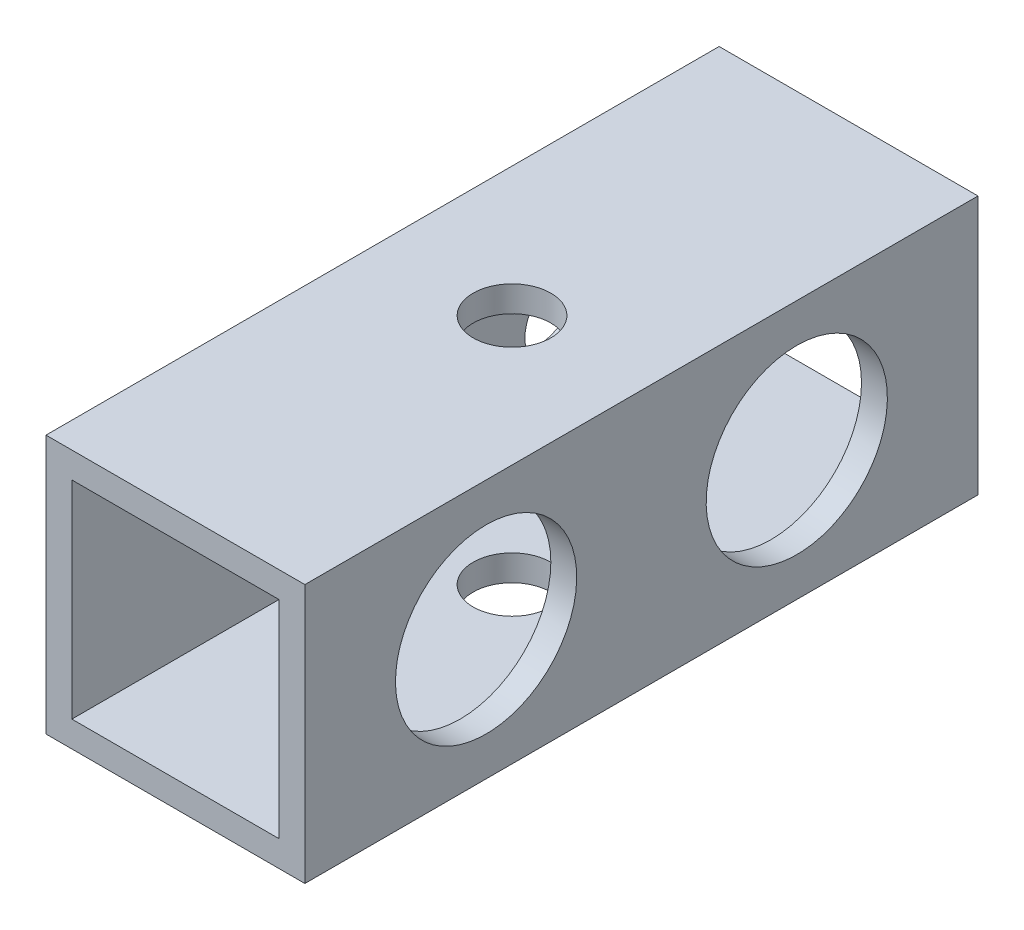
ISO-10303-21;
HEADER;
FILE_DESCRIPTION(('STEP AP214'),'2;1');
FILE_NAME('part.step','',(''),(''),'','','');
FILE_SCHEMA(('AUTOMOTIVE_DESIGN { 1 0 10303 214 1 1 1 1 }'));
ENDSEC;
DATA;
#1=APPLICATION_CONTEXT('core data for automotive mechanical design processes');
#2=APPLICATION_PROTOCOL_DEFINITION('international standard','automotive_design',2000,#1);
#3=PRODUCT_CONTEXT('',#1,'mechanical');
#4=PRODUCT('Part','Part','',(#3));
#5=PRODUCT_RELATED_PRODUCT_CATEGORY('part','',(#4));
#6=PRODUCT_DEFINITION_FORMATION('','',#4);
#7=PRODUCT_DEFINITION_CONTEXT('part definition',#1,'design');
#8=PRODUCT_DEFINITION('design','',#6,#7);
#9=PRODUCT_DEFINITION_SHAPE('','',#8);
#10=(LENGTH_UNIT() NAMED_UNIT(*) SI_UNIT(.MILLI.,.METRE.));
#11=(NAMED_UNIT(*) PLANE_ANGLE_UNIT() SI_UNIT($,.RADIAN.));
#12=(NAMED_UNIT(*) SI_UNIT($,.STERADIAN.) SOLID_ANGLE_UNIT());
#13=UNCERTAINTY_MEASURE_WITH_UNIT(LENGTH_MEASURE(1.E-05),#10,'distance_accuracy_value','');
#14=(GEOMETRIC_REPRESENTATION_CONTEXT(3) GLOBAL_UNCERTAINTY_ASSIGNED_CONTEXT((#13)) GLOBAL_UNIT_ASSIGNED_CONTEXT((#10,
#11,#12)) REPRESENTATION_CONTEXT('',''));
#15=CARTESIAN_POINT('',(0.,0.,0.));
#16=DIRECTION('',(0.,0.,1.));
#17=DIRECTION('',(1.,0.,0.));
#18=AXIS2_PLACEMENT_3D('',#15,#16,#17);
#19=CARTESIAN_POINT('',(0.,0.,26.));
#20=DIRECTION('',(0.,0.,1.));
#21=DIRECTION('',(1.,0.,0.));
#22=AXIS2_PLACEMENT_3D('',#19,#20,#21);
#23=PLANE('',#22);
#24=DIRECTION('',(0.,1.,0.));
#25=VECTOR('',#24,1.);
#26=CARTESIAN_POINT('',(5.,5.,26.));
#27=LINE('',#26,#25);
#28=CARTESIAN_POINT('',(5.,-5.,26.));
#29=VERTEX_POINT('',#28);
#30=CARTESIAN_POINT('',(5.,5.,26.));
#31=VERTEX_POINT('',#30);
#32=EDGE_CURVE('E168',#29,#31,#27,.T.);
#33=ORIENTED_EDGE('',*,*,#32,.T.);
#34=DIRECTION('',(-1.,0.,0.));
#35=VECTOR('',#34,1.);
#36=CARTESIAN_POINT('',(5.,5.,26.));
#37=LINE('',#36,#35);
#38=CARTESIAN_POINT('',(-5.,5.,26.));
#39=VERTEX_POINT('',#38);
#40=EDGE_CURVE('E171',#31,#39,#37,.T.);
#41=ORIENTED_EDGE('',*,*,#40,.T.);
#42=DIRECTION('',(0.,-1.,0.));
#43=VECTOR('',#42,1.);
#44=CARTESIAN_POINT('',(-5.,5.,26.));
#45=LINE('',#44,#43);
#46=CARTESIAN_POINT('',(-5.,-5.,26.));
#47=VERTEX_POINT('',#46);
#48=EDGE_CURVE('E174',#39,#47,#45,.T.);
#49=ORIENTED_EDGE('',*,*,#48,.T.);
#50=DIRECTION('',(1.,0.,0.));
#51=VECTOR('',#50,1.);
#52=CARTESIAN_POINT('',(5.,-5.,26.));
#53=LINE('',#52,#51);
#54=EDGE_CURVE('E176',#47,#29,#53,.T.);
#55=ORIENTED_EDGE('',*,*,#54,.T.);
#56=EDGE_LOOP('',(#33,#41,#49,#55));
#57=FACE_BOUND('',#56,.T.);
#58=DIRECTION('',(-1.,0.,0.));
#59=VECTOR('',#58,1.);
#60=CARTESIAN_POINT('',(0.,4.,26.));
#61=LINE('',#60,#59);
#62=CARTESIAN_POINT('',(4.,4.,26.));
#63=VERTEX_POINT('',#62);
#64=CARTESIAN_POINT('',(-4.,4.,26.));
#65=VERTEX_POINT('',#64);
#66=EDGE_CURVE('E138',#63,#65,#61,.T.);
#67=ORIENTED_EDGE('',*,*,#66,.F.);
#68=DIRECTION('',(0.,1.,0.));
#69=VECTOR('',#68,1.);
#70=CARTESIAN_POINT('',(4.,0.,26.));
#71=LINE('',#70,#69);
#72=CARTESIAN_POINT('',(4.,-4.,26.));
#73=VERTEX_POINT('',#72);
#74=EDGE_CURVE('E130',#73,#63,#71,.T.);
#75=ORIENTED_EDGE('',*,*,#74,.F.);
#76=DIRECTION('',(1.,0.,0.));
#77=VECTOR('',#76,1.);
#78=CARTESIAN_POINT('',(0.,-4.,26.));
#79=LINE('',#78,#77);
#80=CARTESIAN_POINT('',(-4.,-4.,26.));
#81=VERTEX_POINT('',#80);
#82=EDGE_CURVE('E152',#81,#73,#79,.T.);
#83=ORIENTED_EDGE('',*,*,#82,.F.);
#84=DIRECTION('',(0.,-1.,0.));
#85=VECTOR('',#84,1.);
#86=CARTESIAN_POINT('',(-4.,0.,26.));
#87=LINE('',#86,#85);
#88=EDGE_CURVE('E150',#65,#81,#87,.T.);
#89=ORIENTED_EDGE('',*,*,#88,.F.);
#90=EDGE_LOOP('',(#67,#75,#83,#89));
#91=FACE_BOUND('',#90,.T.);
#92=ADVANCED_FACE('F63',(#57,#91),#23,.T.);
#93=CARTESIAN_POINT('',(0.,0.,0.));
#94=DIRECTION('',(0.,0.,1.));
#95=DIRECTION('',(1.,0.,0.));
#96=AXIS2_PLACEMENT_3D('',#93,#94,#95);
#97=PLANE('',#96);
#98=DIRECTION('',(0.,1.,0.));
#99=VECTOR('',#98,1.);
#100=CARTESIAN_POINT('',(5.,5.,0.));
#101=LINE('',#100,#99);
#102=CARTESIAN_POINT('',(5.,-5.,0.));
#103=VERTEX_POINT('',#102);
#104=CARTESIAN_POINT('',(5.,5.,0.));
#105=VERTEX_POINT('',#104);
#106=EDGE_CURVE('E146',#103,#105,#101,.T.);
#107=ORIENTED_EDGE('',*,*,#106,.F.);
#108=DIRECTION('',(1.,0.,0.));
#109=VECTOR('',#108,1.);
#110=CARTESIAN_POINT('',(5.,-5.,0.));
#111=LINE('',#110,#109);
#112=CARTESIAN_POINT('',(-5.,-5.,0.));
#113=VERTEX_POINT('',#112);
#114=EDGE_CURVE('E172',#113,#103,#111,.T.);
#115=ORIENTED_EDGE('',*,*,#114,.F.);
#116=DIRECTION('',(0.,-1.,0.));
#117=VECTOR('',#116,1.);
#118=CARTESIAN_POINT('',(-5.,5.,0.));
#119=LINE('',#118,#117);
#120=CARTESIAN_POINT('',(-5.,5.,0.));
#121=VERTEX_POINT('',#120);
#122=EDGE_CURVE('E183',#121,#113,#119,.T.);
#123=ORIENTED_EDGE('',*,*,#122,.F.);
#124=DIRECTION('',(-1.,0.,0.));
#125=VECTOR('',#124,1.);
#126=CARTESIAN_POINT('',(5.,5.,0.));
#127=LINE('',#126,#125);
#128=EDGE_CURVE('E181',#105,#121,#127,.T.);
#129=ORIENTED_EDGE('',*,*,#128,.F.);
#130=EDGE_LOOP('',(#107,#115,#123,#129));
#131=FACE_BOUND('',#130,.T.);
#132=DIRECTION('',(0.,1.,0.));
#133=VECTOR('',#132,1.);
#134=CARTESIAN_POINT('',(4.,0.,0.));
#135=LINE('',#134,#133);
#136=CARTESIAN_POINT('',(4.,-4.,0.));
#137=VERTEX_POINT('',#136);
#138=CARTESIAN_POINT('',(4.,4.,0.));
#139=VERTEX_POINT('',#138);
#140=EDGE_CURVE('E88',#137,#139,#135,.T.);
#141=ORIENTED_EDGE('',*,*,#140,.T.);
#142=DIRECTION('',(-1.,0.,0.));
#143=VECTOR('',#142,1.);
#144=CARTESIAN_POINT('',(0.,4.,0.));
#145=LINE('',#144,#143);
#146=CARTESIAN_POINT('',(-4.,4.,0.));
#147=VERTEX_POINT('',#146);
#148=EDGE_CURVE('E145',#139,#147,#145,.T.);
#149=ORIENTED_EDGE('',*,*,#148,.T.);
#150=DIRECTION('',(0.,-1.,0.));
#151=VECTOR('',#150,1.);
#152=CARTESIAN_POINT('',(-4.,0.,0.));
#153=LINE('',#152,#151);
#154=CARTESIAN_POINT('',(-4.,-4.,0.));
#155=VERTEX_POINT('',#154);
#156=EDGE_CURVE('E160',#147,#155,#153,.T.);
#157=ORIENTED_EDGE('',*,*,#156,.T.);
#158=DIRECTION('',(1.,0.,0.));
#159=VECTOR('',#158,1.);
#160=CARTESIAN_POINT('',(0.,-4.,0.));
#161=LINE('',#160,#159);
#162=EDGE_CURVE('E139',#155,#137,#161,.T.);
#163=ORIENTED_EDGE('',*,*,#162,.T.);
#164=EDGE_LOOP('',(#141,#149,#157,#163));
#165=FACE_BOUND('',#164,.T.);
#166=ADVANCED_FACE('F248',(#131,#165),#97,.F.);
#167=CARTESIAN_POINT('',(5.,5.,26.));
#168=DIRECTION('',(-1.,0.,0.));
#169=DIRECTION('',(0.,-1.,0.));
#170=AXIS2_PLACEMENT_3D('',#167,#168,#169);
#171=PLANE('',#170);
#172=CARTESIAN_POINT('',(5.,0.,19.));
#173=DIRECTION('',(1.,0.,0.));
#174=DIRECTION('',(0.,1.,0.));
#175=AXIS2_PLACEMENT_3D('',#172,#173,#174);
#176=CIRCLE('',#175,3.5);
#177=CARTESIAN_POINT('',(5.,3.5,19.));
#178=VERTEX_POINT('',#177);
#179=EDGE_CURVE('E205',#178,#178,#176,.T.);
#180=ORIENTED_EDGE('',*,*,#179,.F.);
#181=EDGE_LOOP('',(#180));
#182=FACE_BOUND('',#181,.T.);
#183=CARTESIAN_POINT('',(5.,0.,7.));
#184=DIRECTION('',(1.,0.,0.));
#185=DIRECTION('',(0.,1.,0.));
#186=AXIS2_PLACEMENT_3D('',#183,#184,#185);
#187=CIRCLE('',#186,3.5);
#188=CARTESIAN_POINT('',(5.,3.5,7.));
#189=VERTEX_POINT('',#188);
#190=EDGE_CURVE('E211',#189,#189,#187,.T.);
#191=ORIENTED_EDGE('',*,*,#190,.F.);
#192=EDGE_LOOP('',(#191));
#193=FACE_BOUND('',#192,.T.);
#194=ORIENTED_EDGE('',*,*,#106,.T.);
#195=DIRECTION('',(0.,0.,-1.));
#196=VECTOR('',#195,1.);
#197=CARTESIAN_POINT('',(5.,5.,26.));
#198=LINE('',#197,#196);
#199=EDGE_CURVE('E12',#31,#105,#198,.T.);
#200=ORIENTED_EDGE('',*,*,#199,.F.);
#201=ORIENTED_EDGE('',*,*,#32,.F.);
#202=DIRECTION('',(0.,0.,-1.));
#203=VECTOR('',#202,1.);
#204=CARTESIAN_POINT('',(5.,-5.,26.));
#205=LINE('',#204,#203);
#206=EDGE_CURVE('E178',#29,#103,#205,.T.);
#207=ORIENTED_EDGE('',*,*,#206,.T.);
#208=EDGE_LOOP('',(#194,#200,#201,#207));
#209=FACE_BOUND('',#208,.T.);
#210=ADVANCED_FACE('F65',(#182,#193,#209),#171,.F.);
#211=CARTESIAN_POINT('',(5.,5.,26.));
#212=DIRECTION('',(0.,-1.,0.));
#213=DIRECTION('',(1.,0.,0.));
#214=AXIS2_PLACEMENT_3D('',#211,#212,#213);
#215=PLANE('',#214);
#216=CARTESIAN_POINT('',(0.,5.,13.));
#217=DIRECTION('',(0.,-1.,0.));
#218=DIRECTION('',(0.,0.,-1.));
#219=AXIS2_PLACEMENT_3D('',#216,#217,#218);
#220=CIRCLE('',#219,1.5);
#221=CARTESIAN_POINT('',(0.,5.,11.5));
#222=VERTEX_POINT('',#221);
#223=EDGE_CURVE('E202',#222,#222,#220,.T.);
#224=ORIENTED_EDGE('',*,*,#223,.T.);
#225=EDGE_LOOP('',(#224));
#226=FACE_BOUND('',#225,.T.);
#227=ORIENTED_EDGE('',*,*,#128,.T.);
#228=DIRECTION('',(0.,0.,-1.));
#229=VECTOR('',#228,1.);
#230=CARTESIAN_POINT('',(-5.,5.,26.));
#231=LINE('',#230,#229);
#232=EDGE_CURVE('E72',#39,#121,#231,.T.);
#233=ORIENTED_EDGE('',*,*,#232,.F.);
#234=ORIENTED_EDGE('',*,*,#40,.F.);
#235=ORIENTED_EDGE('',*,*,#199,.T.);
#236=EDGE_LOOP('',(#227,#233,#234,#235));
#237=FACE_BOUND('',#236,.T.);
#238=ADVANCED_FACE('F235',(#226,#237),#215,.F.);
#239=CARTESIAN_POINT('',(-5.,5.,26.));
#240=DIRECTION('',(1.,0.,0.));
#241=DIRECTION('',(0.,1.,0.));
#242=AXIS2_PLACEMENT_3D('',#239,#240,#241);
#243=PLANE('',#242);
#244=CARTESIAN_POINT('',(-5.,0.,7.));
#245=DIRECTION('',(-1.,0.,0.));
#246=DIRECTION('',(0.,0.,1.));
#247=AXIS2_PLACEMENT_3D('',#244,#245,#246);
#248=CIRCLE('',#247,1.5);
#249=CARTESIAN_POINT('',(-5.,0.,8.5));
#250=VERTEX_POINT('',#249);
#251=EDGE_CURVE('E196',#250,#250,#248,.T.);
#252=ORIENTED_EDGE('',*,*,#251,.F.);
#253=EDGE_LOOP('',(#252));
#254=FACE_BOUND('',#253,.T.);
#255=CARTESIAN_POINT('',(-5.,0.,19.));
#256=DIRECTION('',(-1.,0.,0.));
#257=DIRECTION('',(0.,0.,1.));
#258=AXIS2_PLACEMENT_3D('',#255,#256,#257);
#259=CIRCLE('',#258,1.5);
#260=CARTESIAN_POINT('',(-5.,0.,20.5));
#261=VERTEX_POINT('',#260);
#262=EDGE_CURVE('E224',#261,#261,#259,.T.);
#263=ORIENTED_EDGE('',*,*,#262,.F.);
#264=EDGE_LOOP('',(#263));
#265=FACE_BOUND('',#264,.T.);
#266=ORIENTED_EDGE('',*,*,#122,.T.);
#267=DIRECTION('',(0.,0.,-1.));
#268=VECTOR('',#267,1.);
#269=CARTESIAN_POINT('',(-5.,-5.,26.));
#270=LINE('',#269,#268);
#271=EDGE_CURVE('E188',#47,#113,#270,.T.);
#272=ORIENTED_EDGE('',*,*,#271,.F.);
#273=ORIENTED_EDGE('',*,*,#48,.F.);
#274=ORIENTED_EDGE('',*,*,#232,.T.);
#275=EDGE_LOOP('',(#266,#272,#273,#274));
#276=FACE_BOUND('',#275,.T.);
#277=ADVANCED_FACE('F231',(#254,#265,#276),#243,.F.);
#278=CARTESIAN_POINT('',(5.,-5.,26.));
#279=DIRECTION('',(0.,1.,0.));
#280=DIRECTION('',(-1.,0.,0.));
#281=AXIS2_PLACEMENT_3D('',#278,#279,#280);
#282=PLANE('',#281);
#283=CARTESIAN_POINT('',(0.,-5.,13.));
#284=DIRECTION('',(0.,-1.,0.));
#285=DIRECTION('',(0.,0.,-1.));
#286=AXIS2_PLACEMENT_3D('',#283,#284,#285);
#287=CIRCLE('',#286,1.5);
#288=CARTESIAN_POINT('',(0.,-5.,11.5));
#289=VERTEX_POINT('',#288);
#290=EDGE_CURVE('E209',#289,#289,#287,.T.);
#291=ORIENTED_EDGE('',*,*,#290,.F.);
#292=EDGE_LOOP('',(#291));
#293=FACE_BOUND('',#292,.T.);
#294=ORIENTED_EDGE('',*,*,#114,.T.);
#295=ORIENTED_EDGE('',*,*,#206,.F.);
#296=ORIENTED_EDGE('',*,*,#54,.F.);
#297=ORIENTED_EDGE('',*,*,#271,.T.);
#298=EDGE_LOOP('',(#294,#295,#296,#297));
#299=FACE_BOUND('',#298,.T.);
#300=ADVANCED_FACE('F234',(#293,#299),#282,.F.);
#301=CARTESIAN_POINT('',(4.,0.,26.));
#302=DIRECTION('',(-1.,0.,0.));
#303=DIRECTION('',(0.,-1.,0.));
#304=AXIS2_PLACEMENT_3D('',#301,#302,#303);
#305=PLANE('',#304);
#306=CARTESIAN_POINT('',(4.,0.,19.));
#307=DIRECTION('',(-1.,0.,0.));
#308=DIRECTION('',(0.,-1.,0.));
#309=AXIS2_PLACEMENT_3D('',#306,#307,#308);
#310=CIRCLE('',#309,3.5);
#311=CARTESIAN_POINT('',(4.,-3.5,19.));
#312=VERTEX_POINT('',#311);
#313=EDGE_CURVE('E67',#312,#312,#310,.T.);
#314=ORIENTED_EDGE('',*,*,#313,.F.);
#315=EDGE_LOOP('',(#314));
#316=FACE_BOUND('',#315,.T.);
#317=CARTESIAN_POINT('',(4.,0.,7.));
#318=DIRECTION('',(-1.,0.,0.));
#319=DIRECTION('',(0.,-1.,0.));
#320=AXIS2_PLACEMENT_3D('',#317,#318,#319);
#321=CIRCLE('',#320,3.5);
#322=CARTESIAN_POINT('',(4.,-3.5,7.));
#323=VERTEX_POINT('',#322);
#324=EDGE_CURVE('E203',#323,#323,#321,.T.);
#325=ORIENTED_EDGE('',*,*,#324,.F.);
#326=EDGE_LOOP('',(#325));
#327=FACE_BOUND('',#326,.T.);
#328=ORIENTED_EDGE('',*,*,#140,.F.);
#329=DIRECTION('',(0.,0.,-1.));
#330=VECTOR('',#329,1.);
#331=CARTESIAN_POINT('',(4.,-4.,26.));
#332=LINE('',#331,#330);
#333=EDGE_CURVE('E134',#73,#137,#332,.T.);
#334=ORIENTED_EDGE('',*,*,#333,.F.);
#335=ORIENTED_EDGE('',*,*,#74,.T.);
#336=DIRECTION('',(0.,0.,-1.));
#337=VECTOR('',#336,1.);
#338=CARTESIAN_POINT('',(4.,4.,26.));
#339=LINE('',#338,#337);
#340=EDGE_CURVE('E133',#63,#139,#339,.T.);
#341=ORIENTED_EDGE('',*,*,#340,.T.);
#342=EDGE_LOOP('',(#328,#334,#335,#341));
#343=FACE_BOUND('',#342,.T.);
#344=ADVANCED_FACE('F132',(#316,#327,#343),#305,.T.);
#345=CARTESIAN_POINT('',(0.,4.,26.));
#346=DIRECTION('',(0.,-1.,0.));
#347=DIRECTION('',(1.,0.,0.));
#348=AXIS2_PLACEMENT_3D('',#345,#346,#347);
#349=PLANE('',#348);
#350=CARTESIAN_POINT('',(0.,4.,13.));
#351=DIRECTION('',(0.,-1.,0.));
#352=DIRECTION('',(1.,0.,0.));
#353=AXIS2_PLACEMENT_3D('',#350,#351,#352);
#354=CIRCLE('',#353,1.5);
#355=CARTESIAN_POINT('',(1.50000000000001,4.,13.));
#356=VERTEX_POINT('',#355);
#357=EDGE_CURVE('E201',#356,#356,#354,.T.);
#358=ORIENTED_EDGE('',*,*,#357,.F.);
#359=EDGE_LOOP('',(#358));
#360=FACE_BOUND('',#359,.T.);
#361=ORIENTED_EDGE('',*,*,#148,.F.);
#362=ORIENTED_EDGE('',*,*,#340,.F.);
#363=ORIENTED_EDGE('',*,*,#66,.T.);
#364=DIRECTION('',(0.,0.,-1.));
#365=VECTOR('',#364,1.);
#366=CARTESIAN_POINT('',(-4.,4.,26.));
#367=LINE('',#366,#365);
#368=EDGE_CURVE('E147',#65,#147,#367,.T.);
#369=ORIENTED_EDGE('',*,*,#368,.T.);
#370=EDGE_LOOP('',(#361,#362,#363,#369));
#371=FACE_BOUND('',#370,.T.);
#372=ADVANCED_FACE('F142',(#360,#371),#349,.T.);
#373=CARTESIAN_POINT('',(-4.,0.,26.));
#374=DIRECTION('',(1.,0.,0.));
#375=DIRECTION('',(0.,1.,0.));
#376=AXIS2_PLACEMENT_3D('',#373,#374,#375);
#377=PLANE('',#376);
#378=CARTESIAN_POINT('',(-4.,0.,7.));
#379=DIRECTION('',(1.,0.,0.));
#380=DIRECTION('',(0.,1.,0.));
#381=AXIS2_PLACEMENT_3D('',#378,#379,#380);
#382=CIRCLE('',#381,1.5);
#383=CARTESIAN_POINT('',(-4.,1.5,7.));
#384=VERTEX_POINT('',#383);
#385=EDGE_CURVE('E158',#384,#384,#382,.T.);
#386=ORIENTED_EDGE('',*,*,#385,.F.);
#387=EDGE_LOOP('',(#386));
#388=FACE_BOUND('',#387,.T.);
#389=CARTESIAN_POINT('',(-4.,0.,19.));
#390=DIRECTION('',(1.,0.,0.));
#391=DIRECTION('',(0.,1.,0.));
#392=AXIS2_PLACEMENT_3D('',#389,#390,#391);
#393=CIRCLE('',#392,1.5);
#394=CARTESIAN_POINT('',(-4.,1.5,19.));
#395=VERTEX_POINT('',#394);
#396=EDGE_CURVE('E193',#395,#395,#393,.T.);
#397=ORIENTED_EDGE('',*,*,#396,.F.);
#398=EDGE_LOOP('',(#397));
#399=FACE_BOUND('',#398,.T.);
#400=ORIENTED_EDGE('',*,*,#156,.F.);
#401=ORIENTED_EDGE('',*,*,#368,.F.);
#402=ORIENTED_EDGE('',*,*,#88,.T.);
#403=DIRECTION('',(0.,0.,-1.));
#404=VECTOR('',#403,1.);
#405=CARTESIAN_POINT('',(-4.,-4.,26.));
#406=LINE('',#405,#404);
#407=EDGE_CURVE('E80',#81,#155,#406,.T.);
#408=ORIENTED_EDGE('',*,*,#407,.T.);
#409=EDGE_LOOP('',(#400,#401,#402,#408));
#410=FACE_BOUND('',#409,.T.);
#411=ADVANCED_FACE('F301',(#388,#399,#410),#377,.T.);
#412=CARTESIAN_POINT('',(0.,-4.,26.));
#413=DIRECTION('',(0.,1.,0.));
#414=DIRECTION('',(-1.,0.,0.));
#415=AXIS2_PLACEMENT_3D('',#412,#413,#414);
#416=PLANE('',#415);
#417=CARTESIAN_POINT('',(0.,-4.,13.));
#418=DIRECTION('',(0.,1.,0.));
#419=DIRECTION('',(-1.,0.,0.));
#420=AXIS2_PLACEMENT_3D('',#417,#418,#419);
#421=CIRCLE('',#420,1.5);
#422=CARTESIAN_POINT('',(-1.5,-4.,13.));
#423=VERTEX_POINT('',#422);
#424=EDGE_CURVE('E199',#423,#423,#421,.T.);
#425=ORIENTED_EDGE('',*,*,#424,.F.);
#426=EDGE_LOOP('',(#425));
#427=FACE_BOUND('',#426,.T.);
#428=ORIENTED_EDGE('',*,*,#162,.F.);
#429=ORIENTED_EDGE('',*,*,#407,.F.);
#430=ORIENTED_EDGE('',*,*,#82,.T.);
#431=ORIENTED_EDGE('',*,*,#333,.T.);
#432=EDGE_LOOP('',(#428,#429,#430,#431));
#433=FACE_BOUND('',#432,.T.);
#434=ADVANCED_FACE('F297',(#427,#433),#416,.T.);
#435=CARTESIAN_POINT('',(5.,0.,19.));
#436=DIRECTION('',(-1.,0.,0.));
#437=DIRECTION('',(0.,0.,1.));
#438=AXIS2_PLACEMENT_3D('',#435,#436,#437);
#439=CYLINDRICAL_SURFACE('',#438,1.5);
#440=ORIENTED_EDGE('',*,*,#396,.T.);
#441=EDGE_LOOP('',(#440));
#442=FACE_BOUND('',#441,.T.);
#443=ORIENTED_EDGE('',*,*,#262,.T.);
#444=EDGE_LOOP('',(#443));
#445=FACE_BOUND('',#444,.T.);
#446=ADVANCED_FACE('F229',(#442,#445),#439,.F.);
#447=CARTESIAN_POINT('',(5.,0.,7.));
#448=DIRECTION('',(-1.,0.,0.));
#449=DIRECTION('',(0.,0.,1.));
#450=AXIS2_PLACEMENT_3D('',#447,#448,#449);
#451=CYLINDRICAL_SURFACE('',#450,1.5);
#452=ORIENTED_EDGE('',*,*,#385,.T.);
#453=EDGE_LOOP('',(#452));
#454=FACE_BOUND('',#453,.T.);
#455=ORIENTED_EDGE('',*,*,#251,.T.);
#456=EDGE_LOOP('',(#455));
#457=FACE_BOUND('',#456,.T.);
#458=ADVANCED_FACE('F281',(#454,#457),#451,.F.);
#459=CARTESIAN_POINT('',(0.,5.,13.));
#460=DIRECTION('',(0.,-1.,0.));
#461=DIRECTION('',(0.,0.,-1.));
#462=AXIS2_PLACEMENT_3D('',#459,#460,#461);
#463=CYLINDRICAL_SURFACE('',#462,1.5);
#464=ORIENTED_EDGE('',*,*,#424,.T.);
#465=EDGE_LOOP('',(#464));
#466=FACE_BOUND('',#465,.T.);
#467=ORIENTED_EDGE('',*,*,#290,.T.);
#468=EDGE_LOOP('',(#467));
#469=FACE_BOUND('',#468,.T.);
#470=ADVANCED_FACE('F278',(#466,#469),#463,.F.);
#471=ORIENTED_EDGE('',*,*,#357,.T.);
#472=EDGE_LOOP('',(#471));
#473=FACE_BOUND('',#472,.T.);
#474=ORIENTED_EDGE('',*,*,#223,.F.);
#475=EDGE_LOOP('',(#474));
#476=FACE_BOUND('',#475,.T.);
#477=ADVANCED_FACE('F280',(#473,#476),#463,.F.);
#478=CARTESIAN_POINT('',(0.,0.,7.));
#479=DIRECTION('',(1.,0.,0.));
#480=DIRECTION('',(0.,1.,0.));
#481=AXIS2_PLACEMENT_3D('',#478,#479,#480);
#482=CYLINDRICAL_SURFACE('',#481,3.5);
#483=ORIENTED_EDGE('',*,*,#324,.T.);
#484=EDGE_LOOP('',(#483));
#485=FACE_BOUND('',#484,.T.);
#486=ORIENTED_EDGE('',*,*,#190,.T.);
#487=EDGE_LOOP('',(#486));
#488=FACE_BOUND('',#487,.T.);
#489=ADVANCED_FACE('F288',(#485,#488),#482,.F.);
#490=CARTESIAN_POINT('',(0.,0.,19.));
#491=DIRECTION('',(1.,0.,0.));
#492=DIRECTION('',(0.,1.,0.));
#493=AXIS2_PLACEMENT_3D('',#490,#491,#492);
#494=CYLINDRICAL_SURFACE('',#493,3.5);
#495=ORIENTED_EDGE('',*,*,#313,.T.);
#496=EDGE_LOOP('',(#495));
#497=FACE_BOUND('',#496,.T.);
#498=ORIENTED_EDGE('',*,*,#179,.T.);
#499=EDGE_LOOP('',(#498));
#500=FACE_BOUND('',#499,.T.);
#501=ADVANCED_FACE('F393',(#497,#500),#494,.F.);
#502=CLOSED_SHELL('',(#92,#166,#210,#238,#277,#300,#344,#372,#411,#434,#446,#458,#470,#477,#489,#501));
#503=MANIFOLD_SOLID_BREP('B2',#502);
#504=ADVANCED_BREP_SHAPE_REPRESENTATION('',(#18,#503),#14);
#505=SHAPE_DEFINITION_REPRESENTATION(#9,#504);
ENDSEC;
END-ISO-10303-21;
